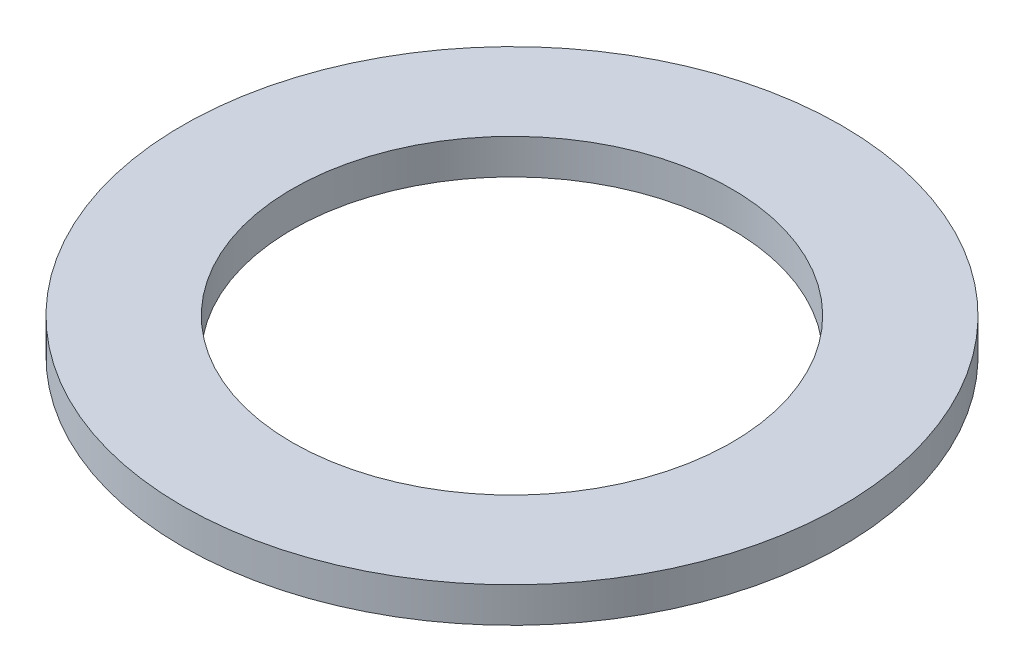
ISO-10303-21;
HEADER;
FILE_DESCRIPTION(('STEP AP214'),'2;1');
FILE_NAME('part.step','',(''),(''),'','','');
FILE_SCHEMA(('AUTOMOTIVE_DESIGN { 1 0 10303 214 1 1 1 1 }'));
ENDSEC;
DATA;
#1=APPLICATION_CONTEXT('core data for automotive mechanical design processes');
#2=APPLICATION_PROTOCOL_DEFINITION('international standard','automotive_design',2000,#1);
#3=PRODUCT_CONTEXT('',#1,'mechanical');
#4=PRODUCT('Part','Part','',(#3));
#5=PRODUCT_RELATED_PRODUCT_CATEGORY('part','',(#4));
#6=PRODUCT_DEFINITION_FORMATION('','',#4);
#7=PRODUCT_DEFINITION_CONTEXT('part definition',#1,'design');
#8=PRODUCT_DEFINITION('design','',#6,#7);
#9=PRODUCT_DEFINITION_SHAPE('','',#8);
#10=(LENGTH_UNIT() NAMED_UNIT(*) SI_UNIT(.MILLI.,.METRE.));
#11=(NAMED_UNIT(*) PLANE_ANGLE_UNIT() SI_UNIT($,.RADIAN.));
#12=(NAMED_UNIT(*) SI_UNIT($,.STERADIAN.) SOLID_ANGLE_UNIT());
#13=UNCERTAINTY_MEASURE_WITH_UNIT(LENGTH_MEASURE(1.E-05),#10,'distance_accuracy_value','');
#14=(GEOMETRIC_REPRESENTATION_CONTEXT(3) GLOBAL_UNCERTAINTY_ASSIGNED_CONTEXT((#13)) GLOBAL_UNIT_ASSIGNED_CONTEXT((#10,
#11,#12)) REPRESENTATION_CONTEXT('',''));
#15=CARTESIAN_POINT('',(0.,0.,0.));
#16=DIRECTION('',(0.,0.,1.));
#17=DIRECTION('',(1.,0.,0.));
#18=AXIS2_PLACEMENT_3D('',#15,#16,#17);
#19=CARTESIAN_POINT('',(0.,8.,0.));
#20=DIRECTION('',(0.,-1.,0.));
#21=DIRECTION('',(0.,0.,-1.));
#22=AXIS2_PLACEMENT_3D('',#19,#20,#21);
#23=CYLINDRICAL_SURFACE('',#22,75.);
#24=CARTESIAN_POINT('',(0.,8.,0.));
#25=DIRECTION('',(0.,1.,0.));
#26=DIRECTION('',(0.,0.,1.));
#27=AXIS2_PLACEMENT_3D('',#24,#25,#26);
#28=CIRCLE('',#27,75.);
#29=CARTESIAN_POINT('',(0.,8.,75.));
#30=VERTEX_POINT('',#29);
#31=EDGE_CURVE('E10',#30,#30,#28,.T.);
#32=ORIENTED_EDGE('',*,*,#31,.F.);
#33=EDGE_LOOP('',(#32));
#34=FACE_BOUND('',#33,.T.);
#35=CARTESIAN_POINT('',(0.,0.,0.));
#36=DIRECTION('',(0.,1.,0.));
#37=DIRECTION('',(0.,0.,1.));
#38=AXIS2_PLACEMENT_3D('',#35,#36,#37);
#39=CIRCLE('',#38,75.);
#40=CARTESIAN_POINT('',(0.,0.,75.));
#41=VERTEX_POINT('',#40);
#42=EDGE_CURVE('E37',#41,#41,#39,.T.);
#43=ORIENTED_EDGE('',*,*,#42,.T.);
#44=EDGE_LOOP('',(#43));
#45=FACE_BOUND('',#44,.T.);
#46=ADVANCED_FACE('F40',(#34,#45),#23,.T.);
#47=CARTESIAN_POINT('',(0.,8.,0.));
#48=DIRECTION('',(0.,1.,0.));
#49=DIRECTION('',(0.,0.,1.));
#50=AXIS2_PLACEMENT_3D('',#47,#48,#49);
#51=PLANE('',#50);
#52=CARTESIAN_POINT('',(0.,8.,0.));
#53=DIRECTION('',(0.,1.,0.));
#54=DIRECTION('',(0.,0.,1.));
#55=AXIS2_PLACEMENT_3D('',#52,#53,#54);
#56=CIRCLE('',#55,50.);
#57=CARTESIAN_POINT('',(0.,8.,50.));
#58=VERTEX_POINT('',#57);
#59=EDGE_CURVE('E50',#58,#58,#56,.T.);
#60=ORIENTED_EDGE('',*,*,#59,.F.);
#61=EDGE_LOOP('',(#60));
#62=FACE_BOUND('',#61,.T.);
#63=ORIENTED_EDGE('',*,*,#31,.T.);
#64=EDGE_LOOP('',(#63));
#65=FACE_BOUND('',#64,.T.);
#66=ADVANCED_FACE('F59',(#62,#65),#51,.T.);
#67=CARTESIAN_POINT('',(0.,0.,0.));
#68=DIRECTION('',(0.,1.,0.));
#69=DIRECTION('',(0.,0.,1.));
#70=AXIS2_PLACEMENT_3D('',#67,#68,#69);
#71=PLANE('',#70);
#72=CARTESIAN_POINT('',(0.,0.,0.));
#73=DIRECTION('',(0.,1.,0.));
#74=DIRECTION('',(0.,0.,1.));
#75=AXIS2_PLACEMENT_3D('',#72,#73,#74);
#76=CIRCLE('',#75,50.);
#77=CARTESIAN_POINT('',(0.,0.,50.));
#78=VERTEX_POINT('',#77);
#79=EDGE_CURVE('E47',#78,#78,#76,.T.);
#80=ORIENTED_EDGE('',*,*,#79,.T.);
#81=EDGE_LOOP('',(#80));
#82=FACE_BOUND('',#81,.T.);
#83=ORIENTED_EDGE('',*,*,#42,.F.);
#84=EDGE_LOOP('',(#83));
#85=FACE_BOUND('',#84,.T.);
#86=ADVANCED_FACE('F58',(#82,#85),#71,.F.);
#87=CARTESIAN_POINT('',(0.,8.,0.));
#88=DIRECTION('',(0.,-1.,0.));
#89=DIRECTION('',(0.,0.,-1.));
#90=AXIS2_PLACEMENT_3D('',#87,#88,#89);
#91=CYLINDRICAL_SURFACE('',#90,50.);
#92=ORIENTED_EDGE('',*,*,#59,.T.);
#93=EDGE_LOOP('',(#92));
#94=FACE_BOUND('',#93,.T.);
#95=ORIENTED_EDGE('',*,*,#79,.F.);
#96=EDGE_LOOP('',(#95));
#97=FACE_BOUND('',#96,.T.);
#98=ADVANCED_FACE('F54',(#94,#97),#91,.F.);
#99=CLOSED_SHELL('',(#46,#66,#86,#98));
#100=MANIFOLD_SOLID_BREP('B2',#99);
#101=ADVANCED_BREP_SHAPE_REPRESENTATION('',(#18,#100),#14);
#102=SHAPE_DEFINITION_REPRESENTATION(#9,#101);
ENDSEC;
END-ISO-10303-21;
